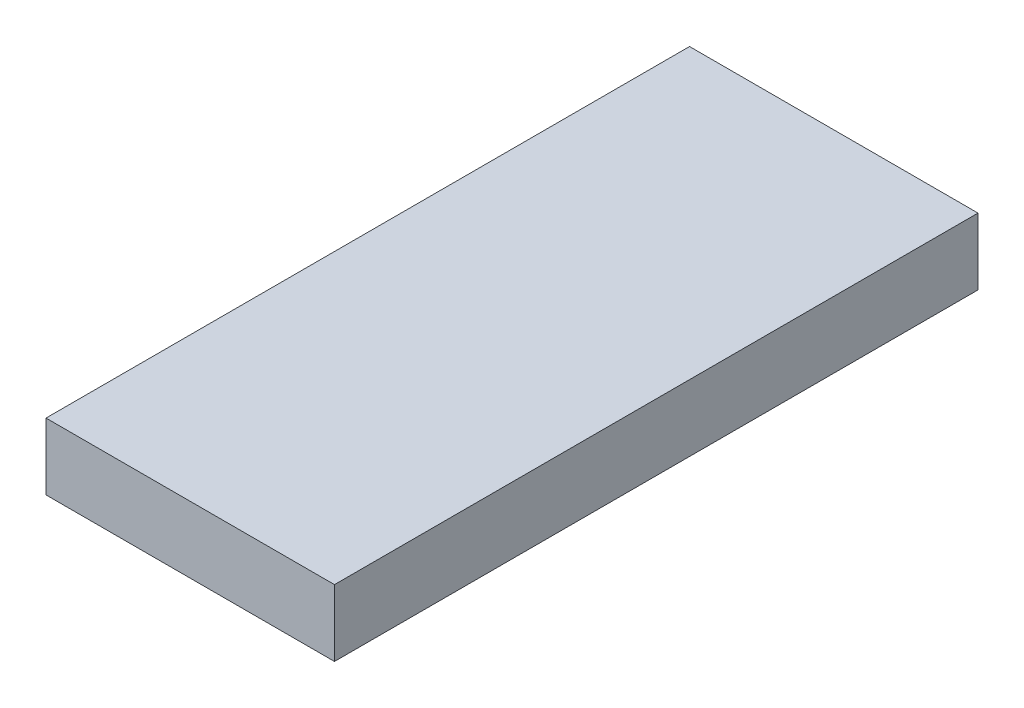
ISO-10303-21;
HEADER;
FILE_DESCRIPTION(('STEP AP214'),'2;1');
FILE_NAME('part.step','',(''),(''),'','','');
FILE_SCHEMA(('AUTOMOTIVE_DESIGN { 1 0 10303 214 1 1 1 1 }'));
ENDSEC;
DATA;
#1=APPLICATION_CONTEXT('core data for automotive mechanical design processes');
#2=APPLICATION_PROTOCOL_DEFINITION('international standard','automotive_design',2000,#1);
#3=PRODUCT_CONTEXT('',#1,'mechanical');
#4=PRODUCT('Part','Part','',(#3));
#5=PRODUCT_RELATED_PRODUCT_CATEGORY('part','',(#4));
#6=PRODUCT_DEFINITION_FORMATION('','',#4);
#7=PRODUCT_DEFINITION_CONTEXT('part definition',#1,'design');
#8=PRODUCT_DEFINITION('design','',#6,#7);
#9=PRODUCT_DEFINITION_SHAPE('','',#8);
#10=(LENGTH_UNIT() NAMED_UNIT(*) SI_UNIT(.MILLI.,.METRE.));
#11=(NAMED_UNIT(*) PLANE_ANGLE_UNIT() SI_UNIT($,.RADIAN.));
#12=(NAMED_UNIT(*) SI_UNIT($,.STERADIAN.) SOLID_ANGLE_UNIT());
#13=UNCERTAINTY_MEASURE_WITH_UNIT(LENGTH_MEASURE(1.E-05),#10,'distance_accuracy_value','');
#14=(GEOMETRIC_REPRESENTATION_CONTEXT(3) GLOBAL_UNCERTAINTY_ASSIGNED_CONTEXT((#13)) GLOBAL_UNIT_ASSIGNED_CONTEXT((#10,
#11,#12)) REPRESENTATION_CONTEXT('',''));
#15=CARTESIAN_POINT('',(0.,0.,0.));
#16=DIRECTION('',(0.,0.,1.));
#17=DIRECTION('',(1.,0.,0.));
#18=AXIS2_PLACEMENT_3D('',#15,#16,#17);
#19=CARTESIAN_POINT('',(-34.5166814642024,18.75,-19.5299990581635));
#20=DIRECTION('',(1.,0.,0.));
#21=DIRECTION('',(0.,0.,-1.));
#22=AXIS2_PLACEMENT_3D('',#19,#20,#21);
#23=PLANE('',#22);
#24=DIRECTION('',(0.,0.,1.));
#25=VECTOR('',#24,1.);
#26=CARTESIAN_POINT('',(-34.5166814642024,0.,-19.5299990581635));
#27=LINE('',#26,#25);
#28=CARTESIAN_POINT('',(-34.5166814642024,0.,-19.5299990581635));
#29=VERTEX_POINT('',#28);
#30=CARTESIAN_POINT('',(-34.5166814642024,0.,161.720000941836));
#31=VERTEX_POINT('',#30);
#32=EDGE_CURVE('E96',#29,#31,#27,.T.);
#33=ORIENTED_EDGE('',*,*,#32,.T.);
#34=DIRECTION('',(0.,-1.,0.));
#35=VECTOR('',#34,1.);
#36=CARTESIAN_POINT('',(-34.5166814642024,18.75,161.720000941836));
#37=LINE('',#36,#35);
#38=CARTESIAN_POINT('',(-34.5166814642024,18.75,161.720000941836));
#39=VERTEX_POINT('',#38);
#40=EDGE_CURVE('E11',#39,#31,#37,.T.);
#41=ORIENTED_EDGE('',*,*,#40,.F.);
#42=DIRECTION('',(0.,0.,1.));
#43=VECTOR('',#42,1.);
#44=CARTESIAN_POINT('',(-34.5166814642024,18.75,-19.5299990581635));
#45=LINE('',#44,#43);
#46=CARTESIAN_POINT('',(-34.5166814642024,18.75,-19.5299990581635));
#47=VERTEX_POINT('',#46);
#48=EDGE_CURVE('E84',#47,#39,#45,.T.);
#49=ORIENTED_EDGE('',*,*,#48,.F.);
#50=DIRECTION('',(0.,-1.,0.));
#51=VECTOR('',#50,1.);
#52=CARTESIAN_POINT('',(-34.5166814642024,18.75,-19.5299990581635));
#53=LINE('',#52,#51);
#54=EDGE_CURVE('E92',#47,#29,#53,.T.);
#55=ORIENTED_EDGE('',*,*,#54,.T.);
#56=EDGE_LOOP('',(#33,#41,#49,#55));
#57=FACE_BOUND('',#56,.T.);
#58=ADVANCED_FACE('F33',(#57),#23,.F.);
#59=CARTESIAN_POINT('',(-34.5166814642024,18.75,161.720000941836));
#60=DIRECTION('',(0.,0.,-1.));
#61=DIRECTION('',(-1.,0.,0.));
#62=AXIS2_PLACEMENT_3D('',#59,#60,#61);
#63=PLANE('',#62);
#64=DIRECTION('',(1.,0.,0.));
#65=VECTOR('',#64,1.);
#66=CARTESIAN_POINT('',(-34.5166814642024,0.,161.720000941836));
#67=LINE('',#66,#65);
#68=CARTESIAN_POINT('',(46.7333185357976,0.,161.720000941836));
#69=VERTEX_POINT('',#68);
#70=EDGE_CURVE('E88',#31,#69,#67,.T.);
#71=ORIENTED_EDGE('',*,*,#70,.T.);
#72=DIRECTION('',(0.,-1.,0.));
#73=VECTOR('',#72,1.);
#74=CARTESIAN_POINT('',(46.7333185357976,18.75,161.720000941836));
#75=LINE('',#74,#73);
#76=CARTESIAN_POINT('',(46.7333185357976,18.75,161.720000941836));
#77=VERTEX_POINT('',#76);
#78=EDGE_CURVE('E41',#77,#69,#75,.T.);
#79=ORIENTED_EDGE('',*,*,#78,.F.);
#80=DIRECTION('',(1.,0.,0.));
#81=VECTOR('',#80,1.);
#82=CARTESIAN_POINT('',(-34.5166814642024,18.75,161.720000941836));
#83=LINE('',#82,#81);
#84=EDGE_CURVE('E79',#39,#77,#83,.T.);
#85=ORIENTED_EDGE('',*,*,#84,.F.);
#86=ORIENTED_EDGE('',*,*,#40,.T.);
#87=EDGE_LOOP('',(#71,#79,#85,#86));
#88=FACE_BOUND('',#87,.T.);
#89=ADVANCED_FACE('F87',(#88),#63,.F.);
#90=CARTESIAN_POINT('',(46.7333185357976,18.75,-19.5299990581635));
#91=DIRECTION('',(-1.,0.,0.));
#92=DIRECTION('',(0.,0.,1.));
#93=AXIS2_PLACEMENT_3D('',#90,#91,#92);
#94=PLANE('',#93);
#95=DIRECTION('',(0.,0.,-1.));
#96=VECTOR('',#95,1.);
#97=CARTESIAN_POINT('',(46.7333185357976,0.,-19.5299990581635));
#98=LINE('',#97,#96);
#99=CARTESIAN_POINT('',(46.7333185357976,0.,-19.5299990581635));
#100=VERTEX_POINT('',#99);
#101=EDGE_CURVE('E66',#69,#100,#98,.T.);
#102=ORIENTED_EDGE('',*,*,#101,.T.);
#103=DIRECTION('',(0.,-1.,0.));
#104=VECTOR('',#103,1.);
#105=CARTESIAN_POINT('',(46.7333185357976,18.75,-19.5299990581635));
#106=LINE('',#105,#104);
#107=CARTESIAN_POINT('',(46.7333185357976,18.75,-19.5299990581635));
#108=VERTEX_POINT('',#107);
#109=EDGE_CURVE('E89',#108,#100,#106,.T.);
#110=ORIENTED_EDGE('',*,*,#109,.F.);
#111=DIRECTION('',(0.,0.,-1.));
#112=VECTOR('',#111,1.);
#113=CARTESIAN_POINT('',(46.7333185357976,18.75,-19.5299990581635));
#114=LINE('',#113,#112);
#115=EDGE_CURVE('E82',#77,#108,#114,.T.);
#116=ORIENTED_EDGE('',*,*,#115,.F.);
#117=ORIENTED_EDGE('',*,*,#78,.T.);
#118=EDGE_LOOP('',(#102,#110,#116,#117));
#119=FACE_BOUND('',#118,.T.);
#120=ADVANCED_FACE('F90',(#119),#94,.F.);
#121=CARTESIAN_POINT('',(-34.5166814642024,18.75,-19.5299990581635));
#122=DIRECTION('',(0.,0.,1.));
#123=DIRECTION('',(1.,0.,0.));
#124=AXIS2_PLACEMENT_3D('',#121,#122,#123);
#125=PLANE('',#124);
#126=DIRECTION('',(-1.,0.,0.));
#127=VECTOR('',#126,1.);
#128=CARTESIAN_POINT('',(-34.5166814642024,0.,-19.5299990581635));
#129=LINE('',#128,#127);
#130=EDGE_CURVE('E72',#100,#29,#129,.T.);
#131=ORIENTED_EDGE('',*,*,#130,.T.);
#132=ORIENTED_EDGE('',*,*,#54,.F.);
#133=DIRECTION('',(-1.,0.,0.));
#134=VECTOR('',#133,1.);
#135=CARTESIAN_POINT('',(-34.5166814642024,18.75,-19.5299990581635));
#136=LINE('',#135,#134);
#137=EDGE_CURVE('E49',#108,#47,#136,.T.);
#138=ORIENTED_EDGE('',*,*,#137,.F.);
#139=ORIENTED_EDGE('',*,*,#109,.T.);
#140=EDGE_LOOP('',(#131,#132,#138,#139));
#141=FACE_BOUND('',#140,.T.);
#142=ADVANCED_FACE('F103',(#141),#125,.F.);
#143=CARTESIAN_POINT('',(0.,18.75,0.));
#144=DIRECTION('',(0.,1.,0.));
#145=DIRECTION('',(0.,0.,1.));
#146=AXIS2_PLACEMENT_3D('',#143,#144,#145);
#147=PLANE('',#146);
#148=ORIENTED_EDGE('',*,*,#48,.T.);
#149=ORIENTED_EDGE('',*,*,#84,.T.);
#150=ORIENTED_EDGE('',*,*,#115,.T.);
#151=ORIENTED_EDGE('',*,*,#137,.T.);
#152=EDGE_LOOP('',(#148,#149,#150,#151));
#153=FACE_BOUND('',#152,.T.);
#154=ADVANCED_FACE('F80',(#153),#147,.T.);
#155=CARTESIAN_POINT('',(0.,0.,0.));
#156=DIRECTION('',(0.,1.,0.));
#157=DIRECTION('',(0.,0.,1.));
#158=AXIS2_PLACEMENT_3D('',#155,#156,#157);
#159=PLANE('',#158);
#160=ORIENTED_EDGE('',*,*,#32,.F.);
#161=ORIENTED_EDGE('',*,*,#130,.F.);
#162=ORIENTED_EDGE('',*,*,#101,.F.);
#163=ORIENTED_EDGE('',*,*,#70,.F.);
#164=EDGE_LOOP('',(#160,#161,#162,#163));
#165=FACE_BOUND('',#164,.T.);
#166=ADVANCED_FACE('F106',(#165),#159,.F.);
#167=CLOSED_SHELL('',(#58,#89,#120,#142,#154,#166));
#168=MANIFOLD_SOLID_BREP('B2',#167);
#169=ADVANCED_BREP_SHAPE_REPRESENTATION('',(#18,#168),#14);
#170=SHAPE_DEFINITION_REPRESENTATION(#9,#169);
ENDSEC;
END-ISO-10303-21;
